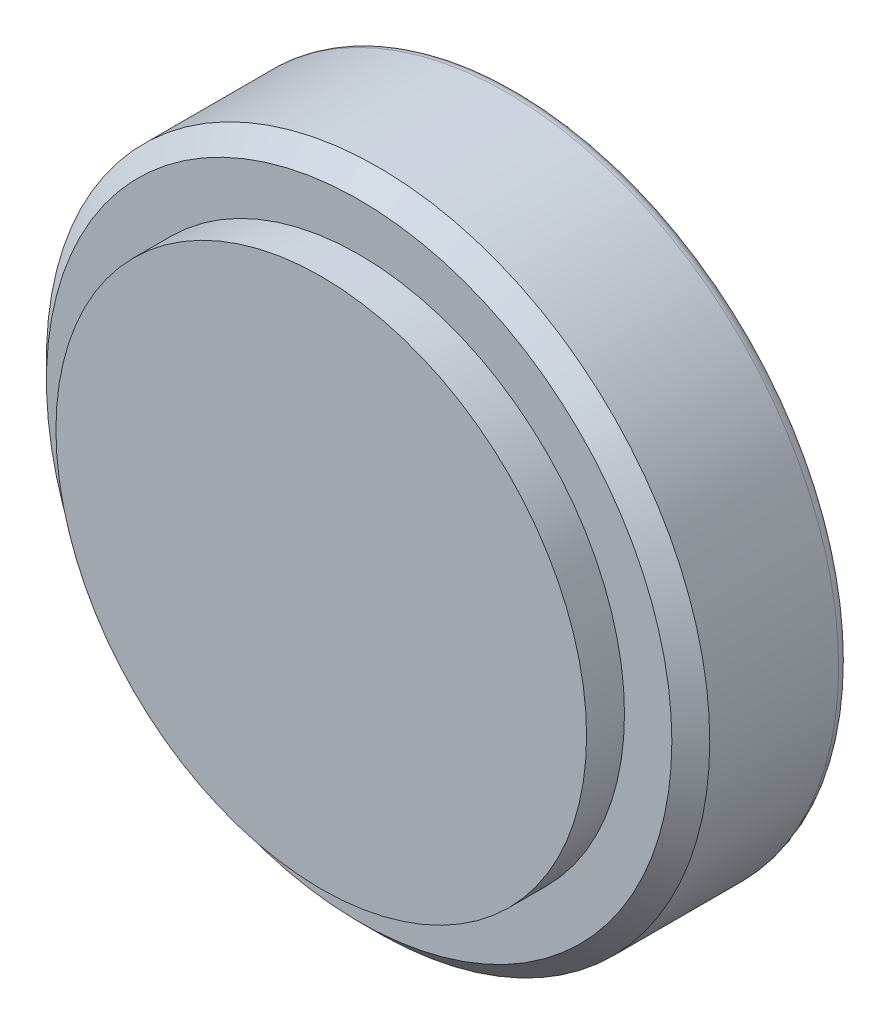
ISO-10303-21;
HEADER;
FILE_DESCRIPTION(('STEP AP214'),'2;1');
FILE_NAME('part.step','',(''),(''),'','','');
FILE_SCHEMA(('AUTOMOTIVE_DESIGN { 1 0 10303 214 1 1 1 1 }'));
ENDSEC;
DATA;
#1=APPLICATION_CONTEXT('core data for automotive mechanical design processes');
#2=APPLICATION_PROTOCOL_DEFINITION('international standard','automotive_design',2000,#1);
#3=PRODUCT_CONTEXT('',#1,'mechanical');
#4=PRODUCT('Part','Part','',(#3));
#5=PRODUCT_RELATED_PRODUCT_CATEGORY('part','',(#4));
#6=PRODUCT_DEFINITION_FORMATION('','',#4);
#7=PRODUCT_DEFINITION_CONTEXT('part definition',#1,'design');
#8=PRODUCT_DEFINITION('design','',#6,#7);
#9=PRODUCT_DEFINITION_SHAPE('','',#8);
#10=(LENGTH_UNIT() NAMED_UNIT(*) SI_UNIT(.MILLI.,.METRE.));
#11=(NAMED_UNIT(*) PLANE_ANGLE_UNIT() SI_UNIT($,.RADIAN.));
#12=(NAMED_UNIT(*) SI_UNIT($,.STERADIAN.) SOLID_ANGLE_UNIT());
#13=UNCERTAINTY_MEASURE_WITH_UNIT(LENGTH_MEASURE(1.E-05),#10,'distance_accuracy_value','');
#14=(GEOMETRIC_REPRESENTATION_CONTEXT(3) GLOBAL_UNCERTAINTY_ASSIGNED_CONTEXT((#13)) GLOBAL_UNIT_ASSIGNED_CONTEXT((#10,
#11,#12)) REPRESENTATION_CONTEXT('',''));
#15=CARTESIAN_POINT('',(0.,0.,0.));
#16=DIRECTION('',(0.,0.,1.));
#17=DIRECTION('',(1.,0.,0.));
#18=AXIS2_PLACEMENT_3D('',#15,#16,#17);
#19=CARTESIAN_POINT('',(0.,0.,26.));
#20=DIRECTION('',(0.,0.,-1.));
#21=DIRECTION('',(-1.,0.,0.));
#22=AXIS2_PLACEMENT_3D('',#19,#20,#21);
#23=CYLINDRICAL_SURFACE('',#22,87.5);
#24=CARTESIAN_POINT('',(0.,0.,-23.));
#25=DIRECTION('',(0.,0.,1.));
#26=DIRECTION('',(1.,0.,0.));
#27=AXIS2_PLACEMENT_3D('',#24,#25,#26);
#28=CIRCLE('',#27,87.5);
#29=CARTESIAN_POINT('',(87.5,0.,-23.));
#30=VERTEX_POINT('',#29);
#31=EDGE_CURVE('E38',#30,#30,#28,.T.);
#32=ORIENTED_EDGE('',*,*,#31,.T.);
#33=EDGE_LOOP('',(#32));
#34=FACE_BOUND('',#33,.T.);
#35=CARTESIAN_POINT('',(0.,0.,11.0000000000001));
#36=DIRECTION('',(0.,0.,1.));
#37=DIRECTION('',(1.,0.,0.));
#38=AXIS2_PLACEMENT_3D('',#35,#36,#37);
#39=CIRCLE('',#38,87.5);
#40=CARTESIAN_POINT('',(87.5,0.,11.0000000000001));
#41=VERTEX_POINT('',#40);
#42=EDGE_CURVE('E42',#41,#41,#39,.F.);
#43=ORIENTED_EDGE('',*,*,#42,.T.);
#44=EDGE_LOOP('',(#43));
#45=FACE_BOUND('',#44,.T.);
#46=ADVANCED_FACE('F31',(#34,#45),#23,.T.);
#47=CARTESIAN_POINT('',(0.,0.,-26.));
#48=DIRECTION('',(0.,0.,1.));
#49=DIRECTION('',(1.,0.,0.));
#50=AXIS2_PLACEMENT_3D('',#47,#48,#49);
#51=PLANE('',#50);
#52=CARTESIAN_POINT('',(0.,0.,-26.));
#53=DIRECTION('',(0.,0.,1.));
#54=DIRECTION('',(1.,0.,0.));
#55=AXIS2_PLACEMENT_3D('',#52,#53,#54);
#56=CIRCLE('',#55,84.5);
#57=CARTESIAN_POINT('',(84.5,0.,-26.));
#58=VERTEX_POINT('',#57);
#59=EDGE_CURVE('E10',#58,#58,#56,.F.);
#60=ORIENTED_EDGE('',*,*,#59,.T.);
#61=EDGE_LOOP('',(#60));
#62=FACE_BOUND('',#61,.T.);
#63=ADVANCED_FACE('F63',(#62),#51,.F.);
#64=CARTESIAN_POINT('',(0.,0.,16.));
#65=DIRECTION('',(0.,0.,1.));
#66=DIRECTION('',(1.,0.,0.));
#67=AXIS2_PLACEMENT_3D('',#64,#65,#66);
#68=PLANE('',#67);
#69=CARTESIAN_POINT('',(0.,0.,16.));
#70=DIRECTION('',(0.,0.,1.));
#71=DIRECTION('',(1.,0.,0.));
#72=AXIS2_PLACEMENT_3D('',#69,#70,#71);
#73=CIRCLE('',#72,82.5);
#74=CARTESIAN_POINT('',(82.5,0.,16.));
#75=VERTEX_POINT('',#74);
#76=EDGE_CURVE('E46',#75,#75,#73,.T.);
#77=ORIENTED_EDGE('',*,*,#76,.T.);
#78=EDGE_LOOP('',(#77));
#79=FACE_BOUND('',#78,.T.);
#80=CARTESIAN_POINT('',(0.,0.,16.));
#81=DIRECTION('',(0.,0.,1.));
#82=DIRECTION('',(1.,0.,0.));
#83=AXIS2_PLACEMENT_3D('',#80,#81,#82);
#84=CIRCLE('',#83,70.);
#85=CARTESIAN_POINT('',(70.,0.,16.));
#86=VERTEX_POINT('',#85);
#87=EDGE_CURVE('E51',#86,#86,#84,.T.);
#88=ORIENTED_EDGE('',*,*,#87,.F.);
#89=EDGE_LOOP('',(#88));
#90=FACE_BOUND('',#89,.T.);
#91=ADVANCED_FACE('F61',(#79,#90),#68,.T.);
#92=CARTESIAN_POINT('',(0.,0.,16.));
#93=DIRECTION('',(0.,0.,1.));
#94=DIRECTION('',(1.,0.,0.));
#95=AXIS2_PLACEMENT_3D('',#92,#93,#94);
#96=CYLINDRICAL_SURFACE('',#95,70.);
#97=ORIENTED_EDGE('',*,*,#87,.T.);
#98=EDGE_LOOP('',(#97));
#99=FACE_BOUND('',#98,.T.);
#100=CARTESIAN_POINT('',(0.,0.,26.));
#101=DIRECTION('',(0.,0.,1.));
#102=DIRECTION('',(1.,0.,0.));
#103=AXIS2_PLACEMENT_3D('',#100,#101,#102);
#104=CIRCLE('',#103,70.);
#105=CARTESIAN_POINT('',(70.,0.,26.));
#106=VERTEX_POINT('',#105);
#107=EDGE_CURVE('E52',#106,#106,#104,.T.);
#108=ORIENTED_EDGE('',*,*,#107,.F.);
#109=EDGE_LOOP('',(#108));
#110=FACE_BOUND('',#109,.T.);
#111=ADVANCED_FACE('F58',(#99,#110),#96,.T.);
#112=CARTESIAN_POINT('',(0.,0.,26.));
#113=DIRECTION('',(0.,0.,1.));
#114=DIRECTION('',(1.,0.,0.));
#115=AXIS2_PLACEMENT_3D('',#112,#113,#114);
#116=PLANE('',#115);
#117=ORIENTED_EDGE('',*,*,#107,.T.);
#118=EDGE_LOOP('',(#117));
#119=FACE_BOUND('',#118,.T.);
#120=ADVANCED_FACE('F70',(#119),#116,.T.);
#121=CARTESIAN_POINT('',(0.,0.,16.));
#122=DIRECTION('',(0.,0.,-1.));
#123=DIRECTION('',(-1.,0.,0.));
#124=AXIS2_PLACEMENT_3D('',#121,#122,#123);
#125=CONICAL_SURFACE('',#124,82.5,0.785398163397451);
#126=ORIENTED_EDGE('',*,*,#42,.F.);
#127=EDGE_LOOP('',(#126));
#128=FACE_BOUND('',#127,.T.);
#129=ORIENTED_EDGE('',*,*,#76,.F.);
#130=EDGE_LOOP('',(#129));
#131=FACE_BOUND('',#130,.T.);
#132=ADVANCED_FACE('F81',(#128,#131),#125,.T.);
#133=CARTESIAN_POINT('',(0.,0.,-23.));
#134=DIRECTION('',(0.,0.,1.));
#135=DIRECTION('',(1.,0.,0.));
#136=AXIS2_PLACEMENT_3D('',#133,#134,#135);
#137=TOROIDAL_SURFACE('',#136,84.5,3.);
#138=ORIENTED_EDGE('',*,*,#59,.F.);
#139=EDGE_LOOP('',(#138));
#140=FACE_BOUND('',#139,.T.);
#141=ORIENTED_EDGE('',*,*,#31,.F.);
#142=EDGE_LOOP('',(#141));
#143=FACE_BOUND('',#142,.T.);
#144=ADVANCED_FACE('F33',(#140,#143),#137,.T.);
#145=CLOSED_SHELL('',(#46,#63,#91,#111,#120,#132,#144));
#146=MANIFOLD_SOLID_BREP('B2',#145);
#147=ADVANCED_BREP_SHAPE_REPRESENTATION('',(#18,#146),#14);
#148=SHAPE_DEFINITION_REPRESENTATION(#9,#147);
ENDSEC;
END-ISO-10303-21;
